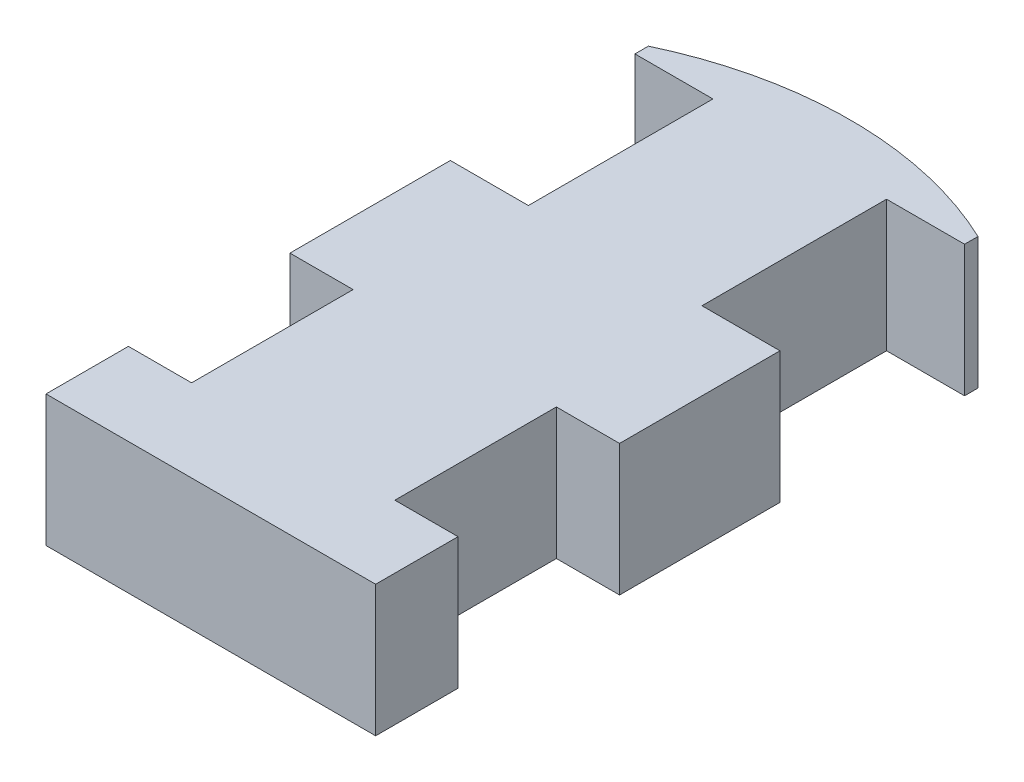
ISO-10303-21;
HEADER;
FILE_DESCRIPTION(('STEP AP214'),'2;1');
FILE_NAME('part.step','',(''),(''),'','','');
FILE_SCHEMA(('AUTOMOTIVE_DESIGN { 1 0 10303 214 1 1 1 1 }'));
ENDSEC;
DATA;
#1=APPLICATION_CONTEXT('core data for automotive mechanical design processes');
#2=APPLICATION_PROTOCOL_DEFINITION('international standard','automotive_design',2000,#1);
#3=PRODUCT_CONTEXT('',#1,'mechanical');
#4=PRODUCT('Part','Part','',(#3));
#5=PRODUCT_RELATED_PRODUCT_CATEGORY('part','',(#4));
#6=PRODUCT_DEFINITION_FORMATION('','',#4);
#7=PRODUCT_DEFINITION_CONTEXT('part definition',#1,'design');
#8=PRODUCT_DEFINITION('design','',#6,#7);
#9=PRODUCT_DEFINITION_SHAPE('','',#8);
#10=(LENGTH_UNIT() NAMED_UNIT(*) SI_UNIT(.MILLI.,.METRE.));
#11=(NAMED_UNIT(*) PLANE_ANGLE_UNIT() SI_UNIT($,.RADIAN.));
#12=(NAMED_UNIT(*) SI_UNIT($,.STERADIAN.) SOLID_ANGLE_UNIT());
#13=UNCERTAINTY_MEASURE_WITH_UNIT(LENGTH_MEASURE(1.E-05),#10,'distance_accuracy_value','');
#14=(GEOMETRIC_REPRESENTATION_CONTEXT(3) GLOBAL_UNCERTAINTY_ASSIGNED_CONTEXT((#13)) GLOBAL_UNIT_ASSIGNED_CONTEXT((#10,
#11,#12)) REPRESENTATION_CONTEXT('',''));
#15=CARTESIAN_POINT('',(0.,0.,0.));
#16=DIRECTION('',(0.,0.,1.));
#17=DIRECTION('',(1.,0.,0.));
#18=AXIS2_PLACEMENT_3D('',#15,#16,#17);
#19=CARTESIAN_POINT('',(-76.2,60.706,109.728));
#20=DIRECTION('',(1.,0.,0.));
#21=DIRECTION('',(0.,0.,-1.));
#22=AXIS2_PLACEMENT_3D('',#19,#20,#21);
#23=PLANE('',#22);
#24=DIRECTION('',(0.,0.,1.));
#25=VECTOR('',#24,1.);
#26=CARTESIAN_POINT('',(-76.2,0.,109.728));
#27=LINE('',#26,#25);
#28=CARTESIAN_POINT('',(-76.2,0.,109.728));
#29=VERTEX_POINT('',#28);
#30=CARTESIAN_POINT('',(-76.2,0.,147.828));
#31=VERTEX_POINT('',#30);
#32=EDGE_CURVE('E201',#29,#31,#27,.T.);
#33=ORIENTED_EDGE('',*,*,#32,.T.);
#34=DIRECTION('',(0.,-1.,0.));
#35=VECTOR('',#34,1.);
#36=CARTESIAN_POINT('',(-76.2,60.706,147.828));
#37=LINE('',#36,#35);
#38=CARTESIAN_POINT('',(-76.2,60.706,147.828));
#39=VERTEX_POINT('',#38);
#40=EDGE_CURVE('E11',#39,#31,#37,.T.);
#41=ORIENTED_EDGE('',*,*,#40,.F.);
#42=DIRECTION('',(0.,0.,1.));
#43=VECTOR('',#42,1.);
#44=CARTESIAN_POINT('',(-76.2,60.706,109.728));
#45=LINE('',#44,#43);
#46=CARTESIAN_POINT('',(-76.2,60.706,109.728));
#47=VERTEX_POINT('',#46);
#48=EDGE_CURVE('E239',#47,#39,#45,.T.);
#49=ORIENTED_EDGE('',*,*,#48,.F.);
#50=DIRECTION('',(0.,-1.,0.));
#51=VECTOR('',#50,1.);
#52=CARTESIAN_POINT('',(-76.2,60.706,109.728));
#53=LINE('',#52,#51);
#54=EDGE_CURVE('E197',#47,#29,#53,.T.);
#55=ORIENTED_EDGE('',*,*,#54,.T.);
#56=EDGE_LOOP('',(#33,#41,#49,#55));
#57=FACE_BOUND('',#56,.T.);
#58=ADVANCED_FACE('F33',(#57),#23,.F.);
#59=CARTESIAN_POINT('',(-76.2,60.706,147.828));
#60=DIRECTION('',(0.,0.,-1.));
#61=DIRECTION('',(-1.,0.,0.));
#62=AXIS2_PLACEMENT_3D('',#59,#60,#61);
#63=PLANE('',#62);
#64=DIRECTION('',(1.,0.,0.));
#65=VECTOR('',#64,1.);
#66=CARTESIAN_POINT('',(-76.2,0.,147.828));
#67=LINE('',#66,#65);
#68=CARTESIAN_POINT('',(76.2,0.,147.828));
#69=VERTEX_POINT('',#68);
#70=EDGE_CURVE('E204',#31,#69,#67,.T.);
#71=ORIENTED_EDGE('',*,*,#70,.T.);
#72=DIRECTION('',(0.,-1.,0.));
#73=VECTOR('',#72,1.);
#74=CARTESIAN_POINT('',(76.2,60.706,147.828));
#75=LINE('',#74,#73);
#76=CARTESIAN_POINT('',(76.2,60.706,147.828));
#77=VERTEX_POINT('',#76);
#78=EDGE_CURVE('E41',#77,#69,#75,.T.);
#79=ORIENTED_EDGE('',*,*,#78,.F.);
#80=DIRECTION('',(1.,0.,0.));
#81=VECTOR('',#80,1.);
#82=CARTESIAN_POINT('',(-76.2,60.706,147.828));
#83=LINE('',#82,#81);
#84=EDGE_CURVE('E128',#39,#77,#83,.T.);
#85=ORIENTED_EDGE('',*,*,#84,.F.);
#86=ORIENTED_EDGE('',*,*,#40,.T.);
#87=EDGE_LOOP('',(#71,#79,#85,#86));
#88=FACE_BOUND('',#87,.T.);
#89=ADVANCED_FACE('F357',(#88),#63,.F.);
#90=CARTESIAN_POINT('',(76.2,60.706,147.828));
#91=DIRECTION('',(-1.,0.,0.));
#92=DIRECTION('',(0.,0.,1.));
#93=AXIS2_PLACEMENT_3D('',#90,#91,#92);
#94=PLANE('',#93);
#95=DIRECTION('',(0.,0.,-1.));
#96=VECTOR('',#95,1.);
#97=CARTESIAN_POINT('',(76.2,0.,147.828));
#98=LINE('',#97,#96);
#99=CARTESIAN_POINT('',(76.2,0.,109.728));
#100=VERTEX_POINT('',#99);
#101=EDGE_CURVE('E206',#69,#100,#98,.T.);
#102=ORIENTED_EDGE('',*,*,#101,.T.);
#103=DIRECTION('',(0.,-1.,0.));
#104=VECTOR('',#103,1.);
#105=CARTESIAN_POINT('',(76.2,60.706,109.728));
#106=LINE('',#105,#104);
#107=CARTESIAN_POINT('',(76.2,60.706,109.728));
#108=VERTEX_POINT('',#107);
#109=EDGE_CURVE('E282',#108,#100,#106,.T.);
#110=ORIENTED_EDGE('',*,*,#109,.F.);
#111=DIRECTION('',(0.,0.,-1.));
#112=VECTOR('',#111,1.);
#113=CARTESIAN_POINT('',(76.2,60.706,147.828));
#114=LINE('',#113,#112);
#115=EDGE_CURVE('E290',#77,#108,#114,.T.);
#116=ORIENTED_EDGE('',*,*,#115,.F.);
#117=ORIENTED_EDGE('',*,*,#78,.T.);
#118=EDGE_LOOP('',(#102,#110,#116,#117));
#119=FACE_BOUND('',#118,.T.);
#120=ADVANCED_FACE('F288',(#119),#94,.F.);
#121=CARTESIAN_POINT('',(76.2,60.706,109.728));
#122=DIRECTION('',(0.,0.,1.));
#123=DIRECTION('',(1.,0.,0.));
#124=AXIS2_PLACEMENT_3D('',#121,#122,#123);
#125=PLANE('',#124);
#126=DIRECTION('',(-1.,0.,0.));
#127=VECTOR('',#126,1.);
#128=CARTESIAN_POINT('',(76.2,0.,109.728));
#129=LINE('',#128,#127);
#130=CARTESIAN_POINT('',(46.99,0.,109.728));
#131=VERTEX_POINT('',#130);
#132=EDGE_CURVE('E208',#100,#131,#129,.T.);
#133=ORIENTED_EDGE('',*,*,#132,.T.);
#134=DIRECTION('',(0.,-1.,0.));
#135=VECTOR('',#134,1.);
#136=CARTESIAN_POINT('',(46.99,60.706,109.728));
#137=LINE('',#136,#135);
#138=CARTESIAN_POINT('',(46.99,60.706,109.728));
#139=VERTEX_POINT('',#138);
#140=EDGE_CURVE('E279',#139,#131,#137,.T.);
#141=ORIENTED_EDGE('',*,*,#140,.F.);
#142=DIRECTION('',(-1.,0.,0.));
#143=VECTOR('',#142,1.);
#144=CARTESIAN_POINT('',(76.2,60.706,109.728));
#145=LINE('',#144,#143);
#146=EDGE_CURVE('E308',#108,#139,#145,.T.);
#147=ORIENTED_EDGE('',*,*,#146,.F.);
#148=ORIENTED_EDGE('',*,*,#109,.T.);
#149=EDGE_LOOP('',(#133,#141,#147,#148));
#150=FACE_BOUND('',#149,.T.);
#151=ADVANCED_FACE('F299',(#150),#125,.F.);
#152=CARTESIAN_POINT('',(46.99,60.706,109.728));
#153=DIRECTION('',(-1.,0.,0.));
#154=DIRECTION('',(0.,0.,1.));
#155=AXIS2_PLACEMENT_3D('',#152,#153,#154);
#156=PLANE('',#155);
#157=DIRECTION('',(0.,0.,-1.));
#158=VECTOR('',#157,1.);
#159=CARTESIAN_POINT('',(46.99,0.,109.728));
#160=LINE('',#159,#158);
#161=CARTESIAN_POINT('',(46.99,0.,35.0520000000001));
#162=VERTEX_POINT('',#161);
#163=EDGE_CURVE('E210',#131,#162,#160,.T.);
#164=ORIENTED_EDGE('',*,*,#163,.T.);
#165=DIRECTION('',(0.,-1.,0.));
#166=VECTOR('',#165,1.);
#167=CARTESIAN_POINT('',(46.99,60.706,35.0520000000001));
#168=LINE('',#167,#166);
#169=CARTESIAN_POINT('',(46.99,60.706,35.0520000000001));
#170=VERTEX_POINT('',#169);
#171=EDGE_CURVE('E276',#170,#162,#168,.T.);
#172=ORIENTED_EDGE('',*,*,#171,.F.);
#173=DIRECTION('',(0.,0.,-1.));
#174=VECTOR('',#173,1.);
#175=CARTESIAN_POINT('',(46.99,60.706,109.728));
#176=LINE('',#175,#174);
#177=EDGE_CURVE('E305',#139,#170,#176,.T.);
#178=ORIENTED_EDGE('',*,*,#177,.F.);
#179=ORIENTED_EDGE('',*,*,#140,.T.);
#180=EDGE_LOOP('',(#164,#172,#178,#179));
#181=FACE_BOUND('',#180,.T.);
#182=ADVANCED_FACE('F303',(#181),#156,.F.);
#183=CARTESIAN_POINT('',(46.99,60.706,35.0520000000001));
#184=DIRECTION('',(0.,0.,-1.));
#185=DIRECTION('',(-1.,0.,0.));
#186=AXIS2_PLACEMENT_3D('',#183,#184,#185);
#187=PLANE('',#186);
#188=DIRECTION('',(1.,0.,0.));
#189=VECTOR('',#188,1.);
#190=CARTESIAN_POINT('',(46.99,0.,35.0520000000001));
#191=LINE('',#190,#189);
#192=CARTESIAN_POINT('',(76.2,0.,35.0520000000001));
#193=VERTEX_POINT('',#192);
#194=EDGE_CURVE('E212',#162,#193,#191,.T.);
#195=ORIENTED_EDGE('',*,*,#194,.T.);
#196=DIRECTION('',(0.,-1.,0.));
#197=VECTOR('',#196,1.);
#198=CARTESIAN_POINT('',(76.2,60.706,35.0520000000001));
#199=LINE('',#198,#197);
#200=CARTESIAN_POINT('',(76.2,60.706,35.0520000000001));
#201=VERTEX_POINT('',#200);
#202=EDGE_CURVE('E273',#201,#193,#199,.T.);
#203=ORIENTED_EDGE('',*,*,#202,.F.);
#204=DIRECTION('',(1.,0.,0.));
#205=VECTOR('',#204,1.);
#206=CARTESIAN_POINT('',(46.99,60.706,35.0520000000001));
#207=LINE('',#206,#205);
#208=EDGE_CURVE('E307',#170,#201,#207,.T.);
#209=ORIENTED_EDGE('',*,*,#208,.F.);
#210=ORIENTED_EDGE('',*,*,#171,.T.);
#211=EDGE_LOOP('',(#195,#203,#209,#210));
#212=FACE_BOUND('',#211,.T.);
#213=ADVANCED_FACE('F370',(#212),#187,.F.);
#214=CARTESIAN_POINT('',(76.2,60.706,35.0520000000001));
#215=DIRECTION('',(-1.,0.,0.));
#216=DIRECTION('',(0.,0.,1.));
#217=AXIS2_PLACEMENT_3D('',#214,#215,#216);
#218=PLANE('',#217);
#219=DIRECTION('',(0.,0.,-1.));
#220=VECTOR('',#219,1.);
#221=CARTESIAN_POINT('',(76.2,0.,35.0520000000001));
#222=LINE('',#221,#220);
#223=CARTESIAN_POINT('',(76.2,0.,-39.1159999999999));
#224=VERTEX_POINT('',#223);
#225=EDGE_CURVE('E214',#193,#224,#222,.T.);
#226=ORIENTED_EDGE('',*,*,#225,.T.);
#227=DIRECTION('',(0.,-1.,0.));
#228=VECTOR('',#227,1.);
#229=CARTESIAN_POINT('',(76.2,60.706,-39.1159999999999));
#230=LINE('',#229,#228);
#231=CARTESIAN_POINT('',(76.2,60.706,-39.1159999999999));
#232=VERTEX_POINT('',#231);
#233=EDGE_CURVE('E270',#232,#224,#230,.T.);
#234=ORIENTED_EDGE('',*,*,#233,.F.);
#235=DIRECTION('',(0.,0.,-1.));
#236=VECTOR('',#235,1.);
#237=CARTESIAN_POINT('',(76.2,60.706,35.0520000000001));
#238=LINE('',#237,#236);
#239=EDGE_CURVE('E310',#201,#232,#238,.T.);
#240=ORIENTED_EDGE('',*,*,#239,.F.);
#241=ORIENTED_EDGE('',*,*,#202,.T.);
#242=EDGE_LOOP('',(#226,#234,#240,#241));
#243=FACE_BOUND('',#242,.T.);
#244=ADVANCED_FACE('F373',(#243),#218,.F.);
#245=CARTESIAN_POINT('',(76.2,60.706,-39.1159999999999));
#246=DIRECTION('',(0.,0.,1.));
#247=DIRECTION('',(1.,0.,0.));
#248=AXIS2_PLACEMENT_3D('',#245,#246,#247);
#249=PLANE('',#248);
#250=DIRECTION('',(-1.,0.,0.));
#251=VECTOR('',#250,1.);
#252=CARTESIAN_POINT('',(76.2,0.,-39.1159999999999));
#253=LINE('',#252,#251);
#254=CARTESIAN_POINT('',(40.132,0.,-39.116));
#255=VERTEX_POINT('',#254);
#256=EDGE_CURVE('E216',#224,#255,#253,.T.);
#257=ORIENTED_EDGE('',*,*,#256,.T.);
#258=DIRECTION('',(0.,-1.,0.));
#259=VECTOR('',#258,1.);
#260=CARTESIAN_POINT('',(40.132,60.706,-39.116));
#261=LINE('',#260,#259);
#262=CARTESIAN_POINT('',(40.132,60.706,-39.116));
#263=VERTEX_POINT('',#262);
#264=EDGE_CURVE('E267',#263,#255,#261,.T.);
#265=ORIENTED_EDGE('',*,*,#264,.F.);
#266=DIRECTION('',(-1.,0.,0.));
#267=VECTOR('',#266,1.);
#268=CARTESIAN_POINT('',(76.2,60.706,-39.1159999999999));
#269=LINE('',#268,#267);
#270=EDGE_CURVE('E316',#232,#263,#269,.T.);
#271=ORIENTED_EDGE('',*,*,#270,.F.);
#272=ORIENTED_EDGE('',*,*,#233,.T.);
#273=EDGE_LOOP('',(#257,#265,#271,#272));
#274=FACE_BOUND('',#273,.T.);
#275=ADVANCED_FACE('F377',(#274),#249,.F.);
#276=CARTESIAN_POINT('',(40.132,60.706,-39.116));
#277=DIRECTION('',(-1.,0.,0.));
#278=DIRECTION('',(0.,0.,1.));
#279=AXIS2_PLACEMENT_3D('',#276,#277,#278);
#280=PLANE('',#279);
#281=DIRECTION('',(0.,0.,-1.));
#282=VECTOR('',#281,1.);
#283=CARTESIAN_POINT('',(40.132,0.,-39.116));
#284=LINE('',#283,#282);
#285=CARTESIAN_POINT('',(40.132,0.,-124.46));
#286=VERTEX_POINT('',#285);
#287=EDGE_CURVE('E218',#255,#286,#284,.T.);
#288=ORIENTED_EDGE('',*,*,#287,.T.);
#289=DIRECTION('',(0.,-1.,0.));
#290=VECTOR('',#289,1.);
#291=CARTESIAN_POINT('',(40.132,60.706,-124.46));
#292=LINE('',#291,#290);
#293=CARTESIAN_POINT('',(40.132,60.706,-124.46));
#294=VERTEX_POINT('',#293);
#295=EDGE_CURVE('E264',#294,#286,#292,.T.);
#296=ORIENTED_EDGE('',*,*,#295,.F.);
#297=DIRECTION('',(0.,0.,-1.));
#298=VECTOR('',#297,1.);
#299=CARTESIAN_POINT('',(40.132,60.706,-39.116));
#300=LINE('',#299,#298);
#301=EDGE_CURVE('E318',#263,#294,#300,.T.);
#302=ORIENTED_EDGE('',*,*,#301,.F.);
#303=ORIENTED_EDGE('',*,*,#264,.T.);
#304=EDGE_LOOP('',(#288,#296,#302,#303));
#305=FACE_BOUND('',#304,.T.);
#306=ADVANCED_FACE('F381',(#305),#280,.F.);
#307=CARTESIAN_POINT('',(40.132,60.706,-124.46));
#308=DIRECTION('',(0.,0.,-1.));
#309=DIRECTION('',(-1.,0.,0.));
#310=AXIS2_PLACEMENT_3D('',#307,#308,#309);
#311=PLANE('',#310);
#312=DIRECTION('',(1.,0.,0.));
#313=VECTOR('',#312,1.);
#314=CARTESIAN_POINT('',(40.132,0.,-124.46));
#315=LINE('',#314,#313);
#316=CARTESIAN_POINT('',(76.2,0.,-124.46));
#317=VERTEX_POINT('',#316);
#318=EDGE_CURVE('E220',#286,#317,#315,.T.);
#319=ORIENTED_EDGE('',*,*,#318,.T.);
#320=DIRECTION('',(0.,-1.,0.));
#321=VECTOR('',#320,1.);
#322=CARTESIAN_POINT('',(76.2,60.706,-124.46));
#323=LINE('',#322,#321);
#324=CARTESIAN_POINT('',(76.2,60.706,-124.46));
#325=VERTEX_POINT('',#324);
#326=EDGE_CURVE('E261',#325,#317,#323,.T.);
#327=ORIENTED_EDGE('',*,*,#326,.F.);
#328=DIRECTION('',(1.,0.,0.));
#329=VECTOR('',#328,1.);
#330=CARTESIAN_POINT('',(40.132,60.706,-124.46));
#331=LINE('',#330,#329);
#332=EDGE_CURVE('E320',#294,#325,#331,.T.);
#333=ORIENTED_EDGE('',*,*,#332,.F.);
#334=ORIENTED_EDGE('',*,*,#295,.T.);
#335=EDGE_LOOP('',(#319,#327,#333,#334));
#336=FACE_BOUND('',#335,.T.);
#337=ADVANCED_FACE('F385',(#336),#311,.F.);
#338=CARTESIAN_POINT('',(76.2,60.706,-124.46));
#339=DIRECTION('',(-1.,0.,0.));
#340=DIRECTION('',(0.,0.,1.));
#341=AXIS2_PLACEMENT_3D('',#338,#339,#340);
#342=PLANE('',#341);
#343=DIRECTION('',(0.,0.,-1.));
#344=VECTOR('',#343,1.);
#345=CARTESIAN_POINT('',(76.2,0.,-124.46));
#346=LINE('',#345,#344);
#347=CARTESIAN_POINT('',(76.2,0.,-130.671705136554));
#348=VERTEX_POINT('',#347);
#349=EDGE_CURVE('E222',#317,#348,#346,.T.);
#350=ORIENTED_EDGE('',*,*,#349,.T.);
#351=DIRECTION('',(0.,-1.,0.));
#352=VECTOR('',#351,1.);
#353=CARTESIAN_POINT('',(76.2,60.706,-130.671705136554));
#354=LINE('',#353,#352);
#355=CARTESIAN_POINT('',(76.2,60.706,-130.671705136554));
#356=VERTEX_POINT('',#355);
#357=EDGE_CURVE('E258',#356,#348,#354,.T.);
#358=ORIENTED_EDGE('',*,*,#357,.F.);
#359=DIRECTION('',(0.,0.,-1.));
#360=VECTOR('',#359,1.);
#361=CARTESIAN_POINT('',(76.2,60.706,-124.46));
#362=LINE('',#361,#360);
#363=EDGE_CURVE('E322',#325,#356,#362,.T.);
#364=ORIENTED_EDGE('',*,*,#363,.F.);
#365=ORIENTED_EDGE('',*,*,#326,.T.);
#366=EDGE_LOOP('',(#350,#358,#364,#365));
#367=FACE_BOUND('',#366,.T.);
#368=ADVANCED_FACE('F389',(#367),#342,.F.);
#369=CARTESIAN_POINT('',(0.,60.706,29.9720000000001));
#370=DIRECTION('',(0.,-1.,0.));
#371=DIRECTION('',(0.,0.,-1.));
#372=AXIS2_PLACEMENT_3D('',#369,#370,#371);
#373=CYLINDRICAL_SURFACE('',#372,177.8);
#374=CARTESIAN_POINT('',(0.,0.,29.9720000000001));
#375=DIRECTION('',(0.,1.,0.));
#376=DIRECTION('',(0.,0.,-1.));
#377=AXIS2_PLACEMENT_3D('',#374,#375,#376);
#378=CIRCLE('',#377,177.8);
#379=CARTESIAN_POINT('',(-76.2000000000001,0.,-130.671705136554));
#380=VERTEX_POINT('',#379);
#381=EDGE_CURVE('E224',#348,#380,#378,.T.);
#382=ORIENTED_EDGE('',*,*,#381,.T.);
#383=DIRECTION('',(0.,-1.,0.));
#384=VECTOR('',#383,1.);
#385=CARTESIAN_POINT('',(-76.2000000000001,60.706,-130.671705136554));
#386=LINE('',#385,#384);
#387=CARTESIAN_POINT('',(-76.2000000000001,60.706,-130.671705136554));
#388=VERTEX_POINT('',#387);
#389=EDGE_CURVE('E255',#388,#380,#386,.T.);
#390=ORIENTED_EDGE('',*,*,#389,.F.);
#391=CARTESIAN_POINT('',(0.,60.706,29.9720000000001));
#392=DIRECTION('',(0.,1.,0.));
#393=DIRECTION('',(0.,0.,-1.));
#394=AXIS2_PLACEMENT_3D('',#391,#392,#393);
#395=CIRCLE('',#394,177.8);
#396=EDGE_CURVE('E324',#356,#388,#395,.T.);
#397=ORIENTED_EDGE('',*,*,#396,.F.);
#398=ORIENTED_EDGE('',*,*,#357,.T.);
#399=EDGE_LOOP('',(#382,#390,#397,#398));
#400=FACE_BOUND('',#399,.T.);
#401=ADVANCED_FACE('F393',(#400),#373,.T.);
#402=CARTESIAN_POINT('',(-76.2,60.706,-130.671705136554));
#403=DIRECTION('',(1.,0.,0.));
#404=DIRECTION('',(0.,0.,-1.));
#405=AXIS2_PLACEMENT_3D('',#402,#403,#404);
#406=PLANE('',#405);
#407=DIRECTION('',(0.,0.,1.));
#408=VECTOR('',#407,1.);
#409=CARTESIAN_POINT('',(-76.2,0.,-130.671705136554));
#410=LINE('',#409,#408);
#411=CARTESIAN_POINT('',(-76.2,0.,-124.46));
#412=VERTEX_POINT('',#411);
#413=EDGE_CURVE('E226',#380,#412,#410,.T.);
#414=ORIENTED_EDGE('',*,*,#413,.T.);
#415=DIRECTION('',(0.,-1.,0.));
#416=VECTOR('',#415,1.);
#417=CARTESIAN_POINT('',(-76.2,60.706,-124.46));
#418=LINE('',#417,#416);
#419=CARTESIAN_POINT('',(-76.2,60.706,-124.46));
#420=VERTEX_POINT('',#419);
#421=EDGE_CURVE('E252',#420,#412,#418,.T.);
#422=ORIENTED_EDGE('',*,*,#421,.F.);
#423=DIRECTION('',(0.,0.,1.));
#424=VECTOR('',#423,1.);
#425=CARTESIAN_POINT('',(-76.2,60.706,-130.671705136554));
#426=LINE('',#425,#424);
#427=EDGE_CURVE('E326',#388,#420,#426,.T.);
#428=ORIENTED_EDGE('',*,*,#427,.F.);
#429=ORIENTED_EDGE('',*,*,#389,.T.);
#430=EDGE_LOOP('',(#414,#422,#428,#429));
#431=FACE_BOUND('',#430,.T.);
#432=ADVANCED_FACE('F397',(#431),#406,.F.);
#433=CARTESIAN_POINT('',(-76.2,60.706,-124.46));
#434=DIRECTION('',(0.,0.,-1.));
#435=DIRECTION('',(-1.,0.,0.));
#436=AXIS2_PLACEMENT_3D('',#433,#434,#435);
#437=PLANE('',#436);
#438=DIRECTION('',(1.,0.,0.));
#439=VECTOR('',#438,1.);
#440=CARTESIAN_POINT('',(-76.2,0.,-124.46));
#441=LINE('',#440,#439);
#442=CARTESIAN_POINT('',(-40.132,0.,-124.46));
#443=VERTEX_POINT('',#442);
#444=EDGE_CURVE('E228',#412,#443,#441,.T.);
#445=ORIENTED_EDGE('',*,*,#444,.T.);
#446=DIRECTION('',(0.,-1.,0.));
#447=VECTOR('',#446,1.);
#448=CARTESIAN_POINT('',(-40.132,60.706,-124.46));
#449=LINE('',#448,#447);
#450=CARTESIAN_POINT('',(-40.132,60.706,-124.46));
#451=VERTEX_POINT('',#450);
#452=EDGE_CURVE('E249',#451,#443,#449,.T.);
#453=ORIENTED_EDGE('',*,*,#452,.F.);
#454=DIRECTION('',(1.,0.,0.));
#455=VECTOR('',#454,1.);
#456=CARTESIAN_POINT('',(-76.2,60.706,-124.46));
#457=LINE('',#456,#455);
#458=EDGE_CURVE('E328',#420,#451,#457,.T.);
#459=ORIENTED_EDGE('',*,*,#458,.F.);
#460=ORIENTED_EDGE('',*,*,#421,.T.);
#461=EDGE_LOOP('',(#445,#453,#459,#460));
#462=FACE_BOUND('',#461,.T.);
#463=ADVANCED_FACE('F401',(#462),#437,.F.);
#464=CARTESIAN_POINT('',(-40.132,60.706,-124.46));
#465=DIRECTION('',(1.,0.,0.));
#466=DIRECTION('',(0.,0.,-1.));
#467=AXIS2_PLACEMENT_3D('',#464,#465,#466);
#468=PLANE('',#467);
#469=DIRECTION('',(0.,0.,1.));
#470=VECTOR('',#469,1.);
#471=CARTESIAN_POINT('',(-40.132,0.,-124.46));
#472=LINE('',#471,#470);
#473=CARTESIAN_POINT('',(-40.132,0.,-39.116));
#474=VERTEX_POINT('',#473);
#475=EDGE_CURVE('E230',#443,#474,#472,.T.);
#476=ORIENTED_EDGE('',*,*,#475,.T.);
#477=DIRECTION('',(0.,-1.,0.));
#478=VECTOR('',#477,1.);
#479=CARTESIAN_POINT('',(-40.132,60.706,-39.116));
#480=LINE('',#479,#478);
#481=CARTESIAN_POINT('',(-40.132,60.706,-39.116));
#482=VERTEX_POINT('',#481);
#483=EDGE_CURVE('E246',#482,#474,#480,.T.);
#484=ORIENTED_EDGE('',*,*,#483,.F.);
#485=DIRECTION('',(0.,0.,1.));
#486=VECTOR('',#485,1.);
#487=CARTESIAN_POINT('',(-40.132,60.706,-124.46));
#488=LINE('',#487,#486);
#489=EDGE_CURVE('E330',#451,#482,#488,.T.);
#490=ORIENTED_EDGE('',*,*,#489,.F.);
#491=ORIENTED_EDGE('',*,*,#452,.T.);
#492=EDGE_LOOP('',(#476,#484,#490,#491));
#493=FACE_BOUND('',#492,.T.);
#494=ADVANCED_FACE('F405',(#493),#468,.F.);
#495=CARTESIAN_POINT('',(-40.132,60.706,-39.116));
#496=DIRECTION('',(0.,0.,1.));
#497=DIRECTION('',(1.,0.,0.));
#498=AXIS2_PLACEMENT_3D('',#495,#496,#497);
#499=PLANE('',#498);
#500=DIRECTION('',(-1.,0.,0.));
#501=VECTOR('',#500,1.);
#502=CARTESIAN_POINT('',(-40.132,0.,-39.116));
#503=LINE('',#502,#501);
#504=CARTESIAN_POINT('',(-76.2,0.,-39.1159999999999));
#505=VERTEX_POINT('',#504);
#506=EDGE_CURVE('E232',#474,#505,#503,.T.);
#507=ORIENTED_EDGE('',*,*,#506,.T.);
#508=DIRECTION('',(0.,-1.,0.));
#509=VECTOR('',#508,1.);
#510=CARTESIAN_POINT('',(-76.2,60.706,-39.1159999999999));
#511=LINE('',#510,#509);
#512=CARTESIAN_POINT('',(-76.2,60.706,-39.1159999999999));
#513=VERTEX_POINT('',#512);
#514=EDGE_CURVE('E243',#513,#505,#511,.T.);
#515=ORIENTED_EDGE('',*,*,#514,.F.);
#516=DIRECTION('',(-1.,0.,0.));
#517=VECTOR('',#516,1.);
#518=CARTESIAN_POINT('',(-40.132,60.706,-39.116));
#519=LINE('',#518,#517);
#520=EDGE_CURVE('E332',#482,#513,#519,.T.);
#521=ORIENTED_EDGE('',*,*,#520,.F.);
#522=ORIENTED_EDGE('',*,*,#483,.T.);
#523=EDGE_LOOP('',(#507,#515,#521,#522));
#524=FACE_BOUND('',#523,.T.);
#525=ADVANCED_FACE('F338',(#524),#499,.F.);
#526=CARTESIAN_POINT('',(-76.2,60.706,-39.1159999999999));
#527=DIRECTION('',(1.,0.,0.));
#528=DIRECTION('',(0.,0.,-1.));
#529=AXIS2_PLACEMENT_3D('',#526,#527,#528);
#530=PLANE('',#529);
#531=DIRECTION('',(0.,0.,1.));
#532=VECTOR('',#531,1.);
#533=CARTESIAN_POINT('',(-76.2,0.,-39.1159999999999));
#534=LINE('',#533,#532);
#535=CARTESIAN_POINT('',(-76.2,0.,35.0520000000001));
#536=VERTEX_POINT('',#535);
#537=EDGE_CURVE('E234',#505,#536,#534,.T.);
#538=ORIENTED_EDGE('',*,*,#537,.T.);
#539=DIRECTION('',(0.,-1.,0.));
#540=VECTOR('',#539,1.);
#541=CARTESIAN_POINT('',(-76.2,60.706,35.0520000000001));
#542=LINE('',#541,#540);
#543=CARTESIAN_POINT('',(-76.2,60.706,35.0520000000001));
#544=VERTEX_POINT('',#543);
#545=EDGE_CURVE('E192',#544,#536,#542,.T.);
#546=ORIENTED_EDGE('',*,*,#545,.F.);
#547=DIRECTION('',(0.,0.,1.));
#548=VECTOR('',#547,1.);
#549=CARTESIAN_POINT('',(-76.2,60.706,-39.1159999999999));
#550=LINE('',#549,#548);
#551=EDGE_CURVE('E183',#513,#544,#550,.T.);
#552=ORIENTED_EDGE('',*,*,#551,.F.);
#553=ORIENTED_EDGE('',*,*,#514,.T.);
#554=EDGE_LOOP('',(#538,#546,#552,#553));
#555=FACE_BOUND('',#554,.T.);
#556=ADVANCED_FACE('F342',(#555),#530,.F.);
#557=CARTESIAN_POINT('',(-76.2,60.706,35.0520000000001));
#558=DIRECTION('',(0.,0.,-1.));
#559=DIRECTION('',(-1.,0.,0.));
#560=AXIS2_PLACEMENT_3D('',#557,#558,#559);
#561=PLANE('',#560);
#562=DIRECTION('',(1.,0.,0.));
#563=VECTOR('',#562,1.);
#564=CARTESIAN_POINT('',(-76.2,0.,35.0520000000001));
#565=LINE('',#564,#563);
#566=CARTESIAN_POINT('',(-46.99,0.,35.0520000000001));
#567=VERTEX_POINT('',#566);
#568=EDGE_CURVE('E191',#536,#567,#565,.T.);
#569=ORIENTED_EDGE('',*,*,#568,.T.);
#570=DIRECTION('',(0.,-1.,0.));
#571=VECTOR('',#570,1.);
#572=CARTESIAN_POINT('',(-46.99,60.706,35.0520000000001));
#573=LINE('',#572,#571);
#574=CARTESIAN_POINT('',(-46.99,60.706,35.0520000000001));
#575=VERTEX_POINT('',#574);
#576=EDGE_CURVE('E188',#575,#567,#573,.T.);
#577=ORIENTED_EDGE('',*,*,#576,.F.);
#578=DIRECTION('',(1.,0.,0.));
#579=VECTOR('',#578,1.);
#580=CARTESIAN_POINT('',(-76.2,60.706,35.0520000000001));
#581=LINE('',#580,#579);
#582=EDGE_CURVE('E177',#544,#575,#581,.T.);
#583=ORIENTED_EDGE('',*,*,#582,.F.);
#584=ORIENTED_EDGE('',*,*,#545,.T.);
#585=EDGE_LOOP('',(#569,#577,#583,#584));
#586=FACE_BOUND('',#585,.T.);
#587=ADVANCED_FACE('F189',(#586),#561,.F.);
#588=CARTESIAN_POINT('',(-46.99,60.706,35.0520000000001));
#589=DIRECTION('',(1.,0.,0.));
#590=DIRECTION('',(0.,0.,-1.));
#591=AXIS2_PLACEMENT_3D('',#588,#589,#590);
#592=PLANE('',#591);
#593=DIRECTION('',(0.,0.,1.));
#594=VECTOR('',#593,1.);
#595=CARTESIAN_POINT('',(-46.99,0.,35.0520000000001));
#596=LINE('',#595,#594);
#597=CARTESIAN_POINT('',(-46.99,0.,109.728));
#598=VERTEX_POINT('',#597);
#599=EDGE_CURVE('E114',#567,#598,#596,.T.);
#600=ORIENTED_EDGE('',*,*,#599,.T.);
#601=DIRECTION('',(0.,-1.,0.));
#602=VECTOR('',#601,1.);
#603=CARTESIAN_POINT('',(-46.99,60.706,109.728));
#604=LINE('',#603,#602);
#605=CARTESIAN_POINT('',(-46.99,60.706,109.728));
#606=VERTEX_POINT('',#605);
#607=EDGE_CURVE('E193',#606,#598,#604,.T.);
#608=ORIENTED_EDGE('',*,*,#607,.F.);
#609=DIRECTION('',(0.,0.,1.));
#610=VECTOR('',#609,1.);
#611=CARTESIAN_POINT('',(-46.99,60.706,35.0520000000001));
#612=LINE('',#611,#610);
#613=EDGE_CURVE('E181',#575,#606,#612,.T.);
#614=ORIENTED_EDGE('',*,*,#613,.F.);
#615=ORIENTED_EDGE('',*,*,#576,.T.);
#616=EDGE_LOOP('',(#600,#608,#614,#615));
#617=FACE_BOUND('',#616,.T.);
#618=ADVANCED_FACE('F195',(#617),#592,.F.);
#619=CARTESIAN_POINT('',(-46.99,60.706,109.728));
#620=DIRECTION('',(0.,0.,1.));
#621=DIRECTION('',(1.,0.,0.));
#622=AXIS2_PLACEMENT_3D('',#619,#620,#621);
#623=PLANE('',#622);
#624=DIRECTION('',(-1.,0.,0.));
#625=VECTOR('',#624,1.);
#626=CARTESIAN_POINT('',(-46.99,0.,109.728));
#627=LINE('',#626,#625);
#628=EDGE_CURVE('E120',#598,#29,#627,.T.);
#629=ORIENTED_EDGE('',*,*,#628,.T.);
#630=ORIENTED_EDGE('',*,*,#54,.F.);
#631=DIRECTION('',(-1.,0.,0.));
#632=VECTOR('',#631,1.);
#633=CARTESIAN_POINT('',(-46.99,60.706,109.728));
#634=LINE('',#633,#632);
#635=EDGE_CURVE('E49',#606,#47,#634,.T.);
#636=ORIENTED_EDGE('',*,*,#635,.F.);
#637=ORIENTED_EDGE('',*,*,#607,.T.);
#638=EDGE_LOOP('',(#629,#630,#636,#637));
#639=FACE_BOUND('',#638,.T.);
#640=ADVANCED_FACE('F346',(#639),#623,.F.);
#641=CARTESIAN_POINT('',(0.,60.706,29.9720000000001));
#642=DIRECTION('',(0.,-1.,0.));
#643=DIRECTION('',(0.,0.,-1.));
#644=AXIS2_PLACEMENT_3D('',#641,#642,#643);
#645=PLANE('',#644);
#646=ORIENTED_EDGE('',*,*,#48,.T.);
#647=ORIENTED_EDGE('',*,*,#84,.T.);
#648=ORIENTED_EDGE('',*,*,#115,.T.);
#649=ORIENTED_EDGE('',*,*,#146,.T.);
#650=ORIENTED_EDGE('',*,*,#177,.T.);
#651=ORIENTED_EDGE('',*,*,#208,.T.);
#652=ORIENTED_EDGE('',*,*,#239,.T.);
#653=ORIENTED_EDGE('',*,*,#270,.T.);
#654=ORIENTED_EDGE('',*,*,#301,.T.);
#655=ORIENTED_EDGE('',*,*,#332,.T.);
#656=ORIENTED_EDGE('',*,*,#363,.T.);
#657=ORIENTED_EDGE('',*,*,#396,.T.);
#658=ORIENTED_EDGE('',*,*,#427,.T.);
#659=ORIENTED_EDGE('',*,*,#458,.T.);
#660=ORIENTED_EDGE('',*,*,#489,.T.);
#661=ORIENTED_EDGE('',*,*,#520,.T.);
#662=ORIENTED_EDGE('',*,*,#551,.T.);
#663=ORIENTED_EDGE('',*,*,#582,.T.);
#664=ORIENTED_EDGE('',*,*,#613,.T.);
#665=ORIENTED_EDGE('',*,*,#635,.T.);
#666=EDGE_LOOP('',(#646,#647,#648,#649,#650,#651,#652,#653,#654,#655,#656,#657,#658,#659,#660,
#661,#662,#663,#664,#665));
#667=FACE_BOUND('',#666,.T.);
#668=ADVANCED_FACE('F179',(#667),#645,.F.);
#669=CARTESIAN_POINT('',(0.,0.,29.9720000000001));
#670=DIRECTION('',(0.,-1.,0.));
#671=DIRECTION('',(0.,0.,-1.));
#672=AXIS2_PLACEMENT_3D('',#669,#670,#671);
#673=PLANE('',#672);
#674=ORIENTED_EDGE('',*,*,#32,.F.);
#675=ORIENTED_EDGE('',*,*,#628,.F.);
#676=ORIENTED_EDGE('',*,*,#599,.F.);
#677=ORIENTED_EDGE('',*,*,#568,.F.);
#678=ORIENTED_EDGE('',*,*,#537,.F.);
#679=ORIENTED_EDGE('',*,*,#506,.F.);
#680=ORIENTED_EDGE('',*,*,#475,.F.);
#681=ORIENTED_EDGE('',*,*,#444,.F.);
#682=ORIENTED_EDGE('',*,*,#413,.F.);
#683=ORIENTED_EDGE('',*,*,#381,.F.);
#684=ORIENTED_EDGE('',*,*,#349,.F.);
#685=ORIENTED_EDGE('',*,*,#318,.F.);
#686=ORIENTED_EDGE('',*,*,#287,.F.);
#687=ORIENTED_EDGE('',*,*,#256,.F.);
#688=ORIENTED_EDGE('',*,*,#225,.F.);
#689=ORIENTED_EDGE('',*,*,#194,.F.);
#690=ORIENTED_EDGE('',*,*,#163,.F.);
#691=ORIENTED_EDGE('',*,*,#132,.F.);
#692=ORIENTED_EDGE('',*,*,#101,.F.);
#693=ORIENTED_EDGE('',*,*,#70,.F.);
#694=EDGE_LOOP('',(#674,#675,#676,#677,#678,#679,#680,#681,#682,#683,#684,#685,#686,#687,#688,
#689,#690,#691,#692,#693));
#695=FACE_BOUND('',#694,.T.);
#696=ADVANCED_FACE('F294',(#695),#673,.T.);
#697=CLOSED_SHELL('',(#58,#89,#120,#151,#182,#213,#244,#275,#306,#337,#368,#401,#432,#463,#494,
#525,#556,#587,#618,#640,#668,#696));
#698=MANIFOLD_SOLID_BREP('B2',#697);
#699=ADVANCED_BREP_SHAPE_REPRESENTATION('',(#18,#698),#14);
#700=SHAPE_DEFINITION_REPRESENTATION(#9,#699);
ENDSEC;
END-ISO-10303-21;
